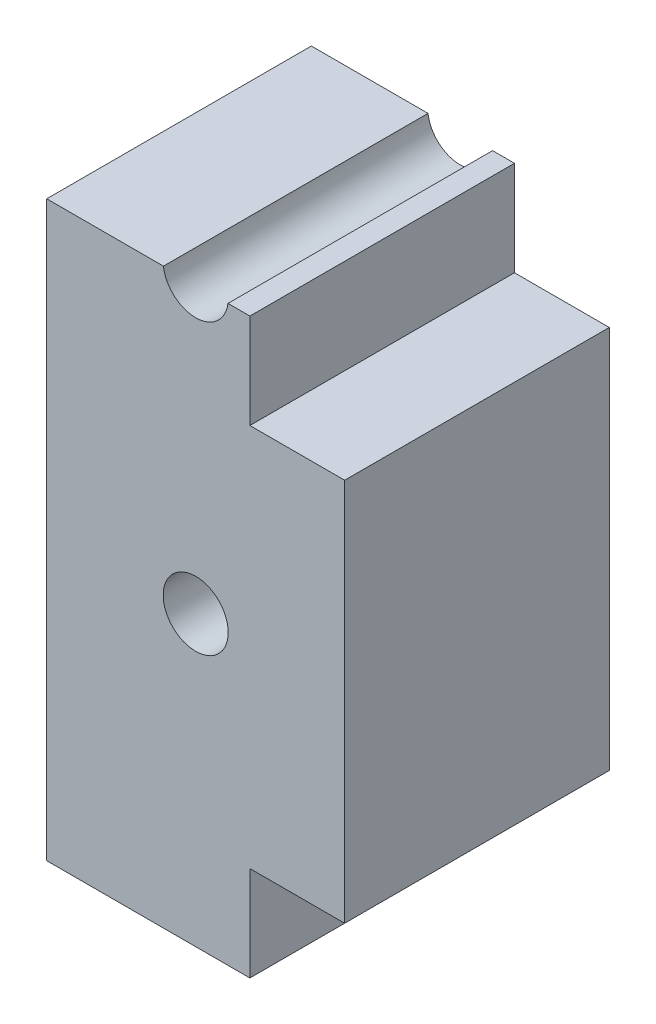
ISO-10303-21;
HEADER;
FILE_DESCRIPTION(('STEP AP214'),'2;1');
FILE_NAME('part.step','',(''),(''),'','','');
FILE_SCHEMA(('AUTOMOTIVE_DESIGN { 1 0 10303 214 1 1 1 1 }'));
ENDSEC;
DATA;
#1=APPLICATION_CONTEXT('core data for automotive mechanical design processes');
#2=APPLICATION_PROTOCOL_DEFINITION('international standard','automotive_design',2000,#1);
#3=PRODUCT_CONTEXT('',#1,'mechanical');
#4=PRODUCT('Part','Part','',(#3));
#5=PRODUCT_RELATED_PRODUCT_CATEGORY('part','',(#4));
#6=PRODUCT_DEFINITION_FORMATION('','',#4);
#7=PRODUCT_DEFINITION_CONTEXT('part definition',#1,'design');
#8=PRODUCT_DEFINITION('design','',#6,#7);
#9=PRODUCT_DEFINITION_SHAPE('','',#8);
#10=(LENGTH_UNIT() NAMED_UNIT(*) SI_UNIT(.MILLI.,.METRE.));
#11=(NAMED_UNIT(*) PLANE_ANGLE_UNIT() SI_UNIT($,.RADIAN.));
#12=(NAMED_UNIT(*) SI_UNIT($,.STERADIAN.) SOLID_ANGLE_UNIT());
#13=UNCERTAINTY_MEASURE_WITH_UNIT(LENGTH_MEASURE(1.E-05),#10,'distance_accuracy_value','');
#14=(GEOMETRIC_REPRESENTATION_CONTEXT(3) GLOBAL_UNCERTAINTY_ASSIGNED_CONTEXT((#13)) GLOBAL_UNIT_ASSIGNED_CONTEXT((#10,
#11,#12)) REPRESENTATION_CONTEXT('',''));
#15=CARTESIAN_POINT('',(0.,0.,0.));
#16=DIRECTION('',(0.,0.,1.));
#17=DIRECTION('',(1.,0.,0.));
#18=AXIS2_PLACEMENT_3D('',#15,#16,#17);
#19=CARTESIAN_POINT('',(8.25,-7.35524959069392,50.4364546937187));
#20=DIRECTION('',(0.,-1.,0.));
#21=DIRECTION('',(0.,0.,-1.));
#22=AXIS2_PLACEMENT_3D('',#19,#20,#21);
#23=PLANE('',#22);
#24=DIRECTION('',(-1.,0.,0.));
#25=VECTOR('',#24,1.);
#26=CARTESIAN_POINT('',(8.25,-7.35524959069392,0.));
#27=LINE('',#26,#25);
#28=CARTESIAN_POINT('',(2.99999999999994,-7.35524959069392,0.));
#29=VERTEX_POINT('',#28);
#30=CARTESIAN_POINT('',(1.78668491117307,-7.35524959069392,0.));
#31=VERTEX_POINT('',#30);
#32=EDGE_CURVE('E139',#29,#31,#27,.T.);
#33=ORIENTED_EDGE('',*,*,#32,.T.);
#34=DIRECTION('',(0.,0.,1.));
#35=VECTOR('',#34,1.);
#36=CARTESIAN_POINT('',(1.78668491117307,-7.35524959069392,0.));
#37=LINE('',#36,#35);
#38=CARTESIAN_POINT('',(1.78668491117307,-7.35524959069392,14.654999999981));
#39=VERTEX_POINT('',#38);
#40=EDGE_CURVE('E118',#31,#39,#37,.T.);
#41=ORIENTED_EDGE('',*,*,#40,.T.);
#42=DIRECTION('',(1.,0.,0.));
#43=VECTOR('',#42,1.);
#44=CARTESIAN_POINT('',(8.25000000000025,-7.35524959069392,14.6549999999811));
#45=LINE('',#44,#43);
#46=CARTESIAN_POINT('',(2.99999999999995,-7.35524959069392,14.654999999981));
#47=VERTEX_POINT('',#46);
#48=EDGE_CURVE('E159',#39,#47,#45,.T.);
#49=ORIENTED_EDGE('',*,*,#48,.T.);
#50=DIRECTION('',(0.,0.,1.));
#51=VECTOR('',#50,1.);
#52=CARTESIAN_POINT('',(2.99999999999994,-7.35524959069392,0.));
#53=LINE('',#52,#51);
#54=EDGE_CURVE('E164',#29,#47,#53,.T.);
#55=ORIENTED_EDGE('',*,*,#54,.F.);
#56=EDGE_LOOP('',(#33,#41,#49,#55));
#57=FACE_BOUND('',#56,.T.);
#58=ADVANCED_FACE('F37',(#57),#23,.F.);
#59=CARTESIAN_POINT('',(0.,0.,0.));
#60=DIRECTION('',(0.,0.,1.));
#61=DIRECTION('',(1.,0.,0.));
#62=AXIS2_PLACEMENT_3D('',#59,#60,#61);
#63=PLANE('',#62);
#64=CARTESIAN_POINT('',(-2.13849991206228E-11,-23.1367157761243,0.));
#65=DIRECTION('',(0.,0.,1.));
#66=DIRECTION('',(1.,0.,0.));
#67=AXIS2_PLACEMENT_3D('',#64,#65,#66);
#68=CIRCLE('',#67,1.8);
#69=CARTESIAN_POINT('',(1.79999999997861,-23.1367157761243,0.));
#70=VERTEX_POINT('',#69);
#71=EDGE_CURVE('E132',#70,#70,#68,.T.);
#72=ORIENTED_EDGE('',*,*,#71,.T.);
#73=EDGE_LOOP('',(#72));
#74=FACE_BOUND('',#73,.T.);
#75=CARTESIAN_POINT('',(-1.78668491121568,-7.35524959069392,0.));
#76=VERTEX_POINT('',#75);
#77=CARTESIAN_POINT('',(-8.25,-7.35524959069392,0.));
#78=VERTEX_POINT('',#77);
#79=EDGE_CURVE('E130',#76,#78,#27,.T.);
#80=ORIENTED_EDGE('',*,*,#79,.F.);
#81=CARTESIAN_POINT('',(-2.13053877126553E-11,-7.13671577612433,0.));
#82=DIRECTION('',(0.,0.,1.));
#83=DIRECTION('',(1.,0.,0.));
#84=AXIS2_PLACEMENT_3D('',#81,#82,#83);
#85=CIRCLE('',#84,1.8);
#86=EDGE_CURVE('E115',#76,#31,#85,.T.);
#87=ORIENTED_EDGE('',*,*,#86,.T.);
#88=ORIENTED_EDGE('',*,*,#32,.F.);
#89=DIRECTION('',(0.,-1.,0.));
#90=VECTOR('',#89,1.);
#91=CARTESIAN_POINT('',(2.99999999999994,-7.35524959069392,0.));
#92=LINE('',#91,#90);
#93=CARTESIAN_POINT('',(2.99999999999995,-12.6052495906939,0.));
#94=VERTEX_POINT('',#93);
#95=EDGE_CURVE('E176',#29,#94,#92,.T.);
#96=ORIENTED_EDGE('',*,*,#95,.T.);
#97=DIRECTION('',(1.,0.,0.));
#98=VECTOR('',#97,1.);
#99=CARTESIAN_POINT('',(8.24999999999995,-12.6052495906939,0.));
#100=LINE('',#99,#98);
#101=CARTESIAN_POINT('',(8.24999999999995,-12.6052495906939,0.));
#102=VERTEX_POINT('',#101);
#103=EDGE_CURVE('E168',#94,#102,#100,.T.);
#104=ORIENTED_EDGE('',*,*,#103,.T.);
#105=DIRECTION('',(0.,1.,0.));
#106=VECTOR('',#105,1.);
#107=CARTESIAN_POINT('',(8.25,-39.1052495906939,0.));
#108=LINE('',#107,#106);
#109=CARTESIAN_POINT('',(8.24999999999994,-33.8552495906939,0.));
#110=VERTEX_POINT('',#109);
#111=EDGE_CURVE('E140',#110,#102,#108,.T.);
#112=ORIENTED_EDGE('',*,*,#111,.F.);
#113=DIRECTION('',(-1.,0.,0.));
#114=VECTOR('',#113,1.);
#115=CARTESIAN_POINT('',(8.24999999999994,-33.8552495906939,0.));
#116=LINE('',#115,#114);
#117=CARTESIAN_POINT('',(2.99999999999994,-33.8552495906939,0.));
#118=VERTEX_POINT('',#117);
#119=EDGE_CURVE('E191',#110,#118,#116,.T.);
#120=ORIENTED_EDGE('',*,*,#119,.T.);
#121=DIRECTION('',(0.,-1.,0.));
#122=VECTOR('',#121,1.);
#123=CARTESIAN_POINT('',(2.99999999999994,-39.1052495906939,0.));
#124=LINE('',#123,#122);
#125=CARTESIAN_POINT('',(2.99999999999994,-39.1052495906939,0.));
#126=VERTEX_POINT('',#125);
#127=EDGE_CURVE('E186',#118,#126,#124,.T.);
#128=ORIENTED_EDGE('',*,*,#127,.T.);
#129=DIRECTION('',(1.,0.,0.));
#130=VECTOR('',#129,1.);
#131=CARTESIAN_POINT('',(8.25,-39.1052495906939,0.));
#132=LINE('',#131,#130);
#133=CARTESIAN_POINT('',(-8.25,-39.1052495906939,0.));
#134=VERTEX_POINT('',#133);
#135=EDGE_CURVE('E147',#134,#126,#132,.T.);
#136=ORIENTED_EDGE('',*,*,#135,.F.);
#137=DIRECTION('',(0.,-1.,0.));
#138=VECTOR('',#137,1.);
#139=CARTESIAN_POINT('',(-8.25,-39.1052495906939,0.));
#140=LINE('',#139,#138);
#141=EDGE_CURVE('E138',#78,#134,#140,.T.);
#142=ORIENTED_EDGE('',*,*,#141,.F.);
#143=EDGE_LOOP('',(#80,#87,#88,#96,#104,#112,#120,#128,#136,#142));
#144=FACE_BOUND('',#143,.T.);
#145=ADVANCED_FACE('F135',(#74,#144),#63,.F.);
#146=CARTESIAN_POINT('',(8.25,-39.1052495906939,50.4364546937187));
#147=DIRECTION('',(0.,1.,0.));
#148=DIRECTION('',(0.,0.,1.));
#149=AXIS2_PLACEMENT_3D('',#146,#147,#148);
#150=PLANE('',#149);
#151=ORIENTED_EDGE('',*,*,#135,.T.);
#152=DIRECTION('',(0.,0.,1.));
#153=VECTOR('',#152,1.);
#154=CARTESIAN_POINT('',(2.99999999999994,-39.1052495906939,0.));
#155=LINE('',#154,#153);
#156=CARTESIAN_POINT('',(2.99999999999994,-39.1052495906939,14.654999999981));
#157=VERTEX_POINT('',#156);
#158=EDGE_CURVE('E143',#126,#157,#155,.T.);
#159=ORIENTED_EDGE('',*,*,#158,.T.);
#160=DIRECTION('',(-1.,0.,0.));
#161=VECTOR('',#160,1.);
#162=CARTESIAN_POINT('',(8.25000000000025,-39.1052495906939,14.6549999999812));
#163=LINE('',#162,#161);
#164=CARTESIAN_POINT('',(-8.25,-39.1052495906939,14.6549999999811));
#165=VERTEX_POINT('',#164);
#166=EDGE_CURVE('E41',#157,#165,#163,.T.);
#167=ORIENTED_EDGE('',*,*,#166,.T.);
#168=DIRECTION('',(0.,0.,-1.));
#169=VECTOR('',#168,1.);
#170=CARTESIAN_POINT('',(-8.25,-39.1052495906939,50.4364546937187));
#171=LINE('',#170,#169);
#172=EDGE_CURVE('E150',#165,#134,#171,.T.);
#173=ORIENTED_EDGE('',*,*,#172,.T.);
#174=EDGE_LOOP('',(#151,#159,#167,#173));
#175=FACE_BOUND('',#174,.T.);
#176=ADVANCED_FACE('F233',(#175),#150,.F.);
#177=CARTESIAN_POINT('',(-8.25,-39.1052495906939,50.4364546937187));
#178=DIRECTION('',(1.,0.,0.));
#179=DIRECTION('',(0.,0.,-1.));
#180=AXIS2_PLACEMENT_3D('',#177,#178,#179);
#181=PLANE('',#180);
#182=ORIENTED_EDGE('',*,*,#172,.F.);
#183=DIRECTION('',(0.,1.,0.));
#184=VECTOR('',#183,1.);
#185=CARTESIAN_POINT('',(-8.25,-39.105249590694,14.654999999981));
#186=LINE('',#185,#184);
#187=CARTESIAN_POINT('',(-8.25,-7.35524959069392,14.6549999999809));
#188=VERTEX_POINT('',#187);
#189=EDGE_CURVE('E154',#165,#188,#186,.T.);
#190=ORIENTED_EDGE('',*,*,#189,.T.);
#191=DIRECTION('',(0.,0.,-1.));
#192=VECTOR('',#191,1.);
#193=CARTESIAN_POINT('',(-8.25,-7.35524959069392,50.4364546937187));
#194=LINE('',#193,#192);
#195=EDGE_CURVE('E151',#188,#78,#194,.T.);
#196=ORIENTED_EDGE('',*,*,#195,.T.);
#197=ORIENTED_EDGE('',*,*,#141,.T.);
#198=EDGE_LOOP('',(#182,#190,#196,#197));
#199=FACE_BOUND('',#198,.T.);
#200=ADVANCED_FACE('F234',(#199),#181,.F.);
#201=CARTESIAN_POINT('',(-1.78668491121568,-7.35524959069392,14.654999999981));
#202=VERTEX_POINT('',#201);
#203=EDGE_CURVE('E46',#188,#202,#45,.T.);
#204=ORIENTED_EDGE('',*,*,#203,.T.);
#205=DIRECTION('',(0.,0.,1.));
#206=VECTOR('',#205,1.);
#207=CARTESIAN_POINT('',(-1.78668491121568,-7.35524959069392,0.));
#208=LINE('',#207,#206);
#209=EDGE_CURVE('E54',#202,#76,#208,.F.);
#210=ORIENTED_EDGE('',*,*,#209,.T.);
#211=ORIENTED_EDGE('',*,*,#79,.T.);
#212=ORIENTED_EDGE('',*,*,#195,.F.);
#213=EDGE_LOOP('',(#204,#210,#211,#212));
#214=FACE_BOUND('',#213,.T.);
#215=ADVANCED_FACE('F128',(#214),#23,.F.);
#216=CARTESIAN_POINT('',(8.25,-39.1052495906939,50.4364546937187));
#217=DIRECTION('',(-1.,0.,0.));
#218=DIRECTION('',(0.,0.,1.));
#219=AXIS2_PLACEMENT_3D('',#216,#217,#218);
#220=PLANE('',#219);
#221=DIRECTION('',(0.,-1.,0.));
#222=VECTOR('',#221,1.);
#223=CARTESIAN_POINT('',(8.25,-39.105249590694,14.6549999999812));
#224=LINE('',#223,#222);
#225=CARTESIAN_POINT('',(8.24999999999995,-12.6052495906939,14.654999999981));
#226=VERTEX_POINT('',#225);
#227=CARTESIAN_POINT('',(8.25,-33.8552495906939,14.6549999999811));
#228=VERTEX_POINT('',#227);
#229=EDGE_CURVE('E11',#226,#228,#224,.T.);
#230=ORIENTED_EDGE('',*,*,#229,.T.);
#231=DIRECTION('',(0.,0.,1.));
#232=VECTOR('',#231,1.);
#233=CARTESIAN_POINT('',(8.24999999999994,-33.8552495906939,0.));
#234=LINE('',#233,#232);
#235=EDGE_CURVE('E62',#110,#228,#234,.T.);
#236=ORIENTED_EDGE('',*,*,#235,.F.);
#237=ORIENTED_EDGE('',*,*,#111,.T.);
#238=DIRECTION('',(0.,0.,1.));
#239=VECTOR('',#238,1.);
#240=CARTESIAN_POINT('',(8.24999999999995,-12.6052495906939,0.));
#241=LINE('',#240,#239);
#242=EDGE_CURVE('E170',#102,#226,#241,.T.);
#243=ORIENTED_EDGE('',*,*,#242,.T.);
#244=EDGE_LOOP('',(#230,#236,#237,#243));
#245=FACE_BOUND('',#244,.T.);
#246=ADVANCED_FACE('F39',(#245),#220,.F.);
#247=CARTESIAN_POINT('',(-18.0994560273988,-15.352062497349,14.6549999999809));
#248=DIRECTION('',(0.,0.,-1.));
#249=DIRECTION('',(-1.,0.,0.));
#250=AXIS2_PLACEMENT_3D('',#247,#248,#249);
#251=PLANE('',#250);
#252=CARTESIAN_POINT('',(-2.13849991206228E-11,-23.1367157761243,14.654999999981));
#253=DIRECTION('',(0.,0.,1.));
#254=DIRECTION('',(1.,0.,0.));
#255=AXIS2_PLACEMENT_3D('',#252,#253,#254);
#256=CIRCLE('',#255,1.8);
#257=CARTESIAN_POINT('',(1.79999999997861,-23.1367157761243,14.654999999981));
#258=VERTEX_POINT('',#257);
#259=EDGE_CURVE('E123',#258,#258,#256,.T.);
#260=ORIENTED_EDGE('',*,*,#259,.F.);
#261=EDGE_LOOP('',(#260));
#262=FACE_BOUND('',#261,.T.);
#263=ORIENTED_EDGE('',*,*,#48,.F.);
#264=CARTESIAN_POINT('',(-2.13053877126553E-11,-7.13671577612433,14.654999999981));
#265=DIRECTION('',(0.,0.,1.));
#266=DIRECTION('',(1.,0.,0.));
#267=AXIS2_PLACEMENT_3D('',#264,#265,#266);
#268=CIRCLE('',#267,1.8);
#269=EDGE_CURVE('E124',#202,#39,#268,.T.);
#270=ORIENTED_EDGE('',*,*,#269,.F.);
#271=ORIENTED_EDGE('',*,*,#203,.F.);
#272=ORIENTED_EDGE('',*,*,#189,.F.);
#273=ORIENTED_EDGE('',*,*,#166,.F.);
#274=DIRECTION('',(0.,-1.,0.));
#275=VECTOR('',#274,1.);
#276=CARTESIAN_POINT('',(2.99999999999994,-39.1052495906939,14.654999999981));
#277=LINE('',#276,#275);
#278=CARTESIAN_POINT('',(2.99999999999994,-33.8552495906939,14.654999999981));
#279=VERTEX_POINT('',#278);
#280=EDGE_CURVE('E189',#279,#157,#277,.T.);
#281=ORIENTED_EDGE('',*,*,#280,.F.);
#282=DIRECTION('',(-1.,0.,0.));
#283=VECTOR('',#282,1.);
#284=CARTESIAN_POINT('',(8.24999999999994,-33.8552495906939,14.654999999981));
#285=LINE('',#284,#283);
#286=EDGE_CURVE('E173',#228,#279,#285,.T.);
#287=ORIENTED_EDGE('',*,*,#286,.F.);
#288=ORIENTED_EDGE('',*,*,#229,.F.);
#289=DIRECTION('',(1.,0.,0.));
#290=VECTOR('',#289,1.);
#291=CARTESIAN_POINT('',(8.24999999999995,-12.6052495906939,14.654999999981));
#292=LINE('',#291,#290);
#293=CARTESIAN_POINT('',(2.99999999999995,-12.6052495906939,14.654999999981));
#294=VERTEX_POINT('',#293);
#295=EDGE_CURVE('E174',#294,#226,#292,.T.);
#296=ORIENTED_EDGE('',*,*,#295,.F.);
#297=DIRECTION('',(0.,-1.,0.));
#298=VECTOR('',#297,1.);
#299=CARTESIAN_POINT('',(2.99999999999994,-7.35524959069392,14.654999999981));
#300=LINE('',#299,#298);
#301=EDGE_CURVE('E177',#47,#294,#300,.T.);
#302=ORIENTED_EDGE('',*,*,#301,.F.);
#303=EDGE_LOOP('',(#263,#270,#271,#272,#273,#281,#287,#288,#296,#302));
#304=FACE_BOUND('',#303,.T.);
#305=ADVANCED_FACE('F211',(#262,#304),#251,.F.);
#306=CARTESIAN_POINT('',(8.24999999999995,-12.6052495906939,0.));
#307=DIRECTION('',(0.,-1.,0.));
#308=DIRECTION('',(1.,0.,0.));
#309=AXIS2_PLACEMENT_3D('',#306,#307,#308);
#310=PLANE('',#309);
#311=ORIENTED_EDGE('',*,*,#295,.T.);
#312=ORIENTED_EDGE('',*,*,#242,.F.);
#313=ORIENTED_EDGE('',*,*,#103,.F.);
#314=DIRECTION('',(0.,0.,1.));
#315=VECTOR('',#314,1.);
#316=CARTESIAN_POINT('',(2.99999999999995,-12.6052495906939,0.));
#317=LINE('',#316,#315);
#318=EDGE_CURVE('E167',#94,#294,#317,.T.);
#319=ORIENTED_EDGE('',*,*,#318,.T.);
#320=EDGE_LOOP('',(#311,#312,#313,#319));
#321=FACE_BOUND('',#320,.T.);
#322=ADVANCED_FACE('F214',(#321),#310,.F.);
#323=CARTESIAN_POINT('',(2.99999999999994,-7.35524959069392,0.));
#324=DIRECTION('',(-1.,0.,0.));
#325=DIRECTION('',(0.,-1.,0.));
#326=AXIS2_PLACEMENT_3D('',#323,#324,#325);
#327=PLANE('',#326);
#328=ORIENTED_EDGE('',*,*,#301,.T.);
#329=ORIENTED_EDGE('',*,*,#318,.F.);
#330=ORIENTED_EDGE('',*,*,#95,.F.);
#331=ORIENTED_EDGE('',*,*,#54,.T.);
#332=EDGE_LOOP('',(#328,#329,#330,#331));
#333=FACE_BOUND('',#332,.T.);
#334=ADVANCED_FACE('F222',(#333),#327,.F.);
#335=CARTESIAN_POINT('',(2.99999999999994,-39.1052495906939,0.));
#336=DIRECTION('',(-1.,0.,0.));
#337=DIRECTION('',(0.,-1.,0.));
#338=AXIS2_PLACEMENT_3D('',#335,#336,#337);
#339=PLANE('',#338);
#340=ORIENTED_EDGE('',*,*,#280,.T.);
#341=ORIENTED_EDGE('',*,*,#158,.F.);
#342=ORIENTED_EDGE('',*,*,#127,.F.);
#343=DIRECTION('',(0.,0.,1.));
#344=VECTOR('',#343,1.);
#345=CARTESIAN_POINT('',(2.99999999999994,-33.8552495906939,0.));
#346=LINE('',#345,#344);
#347=EDGE_CURVE('E185',#118,#279,#346,.T.);
#348=ORIENTED_EDGE('',*,*,#347,.T.);
#349=EDGE_LOOP('',(#340,#341,#342,#348));
#350=FACE_BOUND('',#349,.T.);
#351=ADVANCED_FACE('F232',(#350),#339,.F.);
#352=CARTESIAN_POINT('',(8.24999999999994,-33.8552495906939,0.));
#353=DIRECTION('',(0.,1.,0.));
#354=DIRECTION('',(-1.,0.,0.));
#355=AXIS2_PLACEMENT_3D('',#352,#353,#354);
#356=PLANE('',#355);
#357=ORIENTED_EDGE('',*,*,#286,.T.);
#358=ORIENTED_EDGE('',*,*,#347,.F.);
#359=ORIENTED_EDGE('',*,*,#119,.F.);
#360=ORIENTED_EDGE('',*,*,#235,.T.);
#361=EDGE_LOOP('',(#357,#358,#359,#360));
#362=FACE_BOUND('',#361,.T.);
#363=ADVANCED_FACE('F229',(#362),#356,.F.);
#364=CARTESIAN_POINT('',(-2.13053877126553E-11,-7.13671577612433,0.));
#365=DIRECTION('',(0.,0.,1.));
#366=DIRECTION('',(1.,0.,0.));
#367=AXIS2_PLACEMENT_3D('',#364,#365,#366);
#368=CYLINDRICAL_SURFACE('',#367,1.8);
#369=ORIENTED_EDGE('',*,*,#86,.F.);
#370=ORIENTED_EDGE('',*,*,#209,.F.);
#371=ORIENTED_EDGE('',*,*,#269,.T.);
#372=ORIENTED_EDGE('',*,*,#40,.F.);
#373=EDGE_LOOP('',(#369,#370,#371,#372));
#374=FACE_BOUND('',#373,.T.);
#375=ADVANCED_FACE('F116',(#374),#368,.F.);
#376=CARTESIAN_POINT('',(-2.13849991206228E-11,-23.1367157761243,0.));
#377=DIRECTION('',(0.,0.,1.));
#378=DIRECTION('',(1.,0.,0.));
#379=AXIS2_PLACEMENT_3D('',#376,#377,#378);
#380=CYLINDRICAL_SURFACE('',#379,1.8);
#381=ORIENTED_EDGE('',*,*,#71,.F.);
#382=EDGE_LOOP('',(#381));
#383=FACE_BOUND('',#382,.T.);
#384=ORIENTED_EDGE('',*,*,#259,.T.);
#385=EDGE_LOOP('',(#384));
#386=FACE_BOUND('',#385,.T.);
#387=ADVANCED_FACE('F205',(#383,#386),#380,.F.);
#388=CLOSED_SHELL('',(#58,#145,#176,#200,#215,#246,#305,#322,#334,#351,#363,#375,#387));
#389=MANIFOLD_SOLID_BREP('B2',#388);
#390=ADVANCED_BREP_SHAPE_REPRESENTATION('',(#18,#389),#14);
#391=SHAPE_DEFINITION_REPRESENTATION(#9,#390);
ENDSEC;
END-ISO-10303-21;
